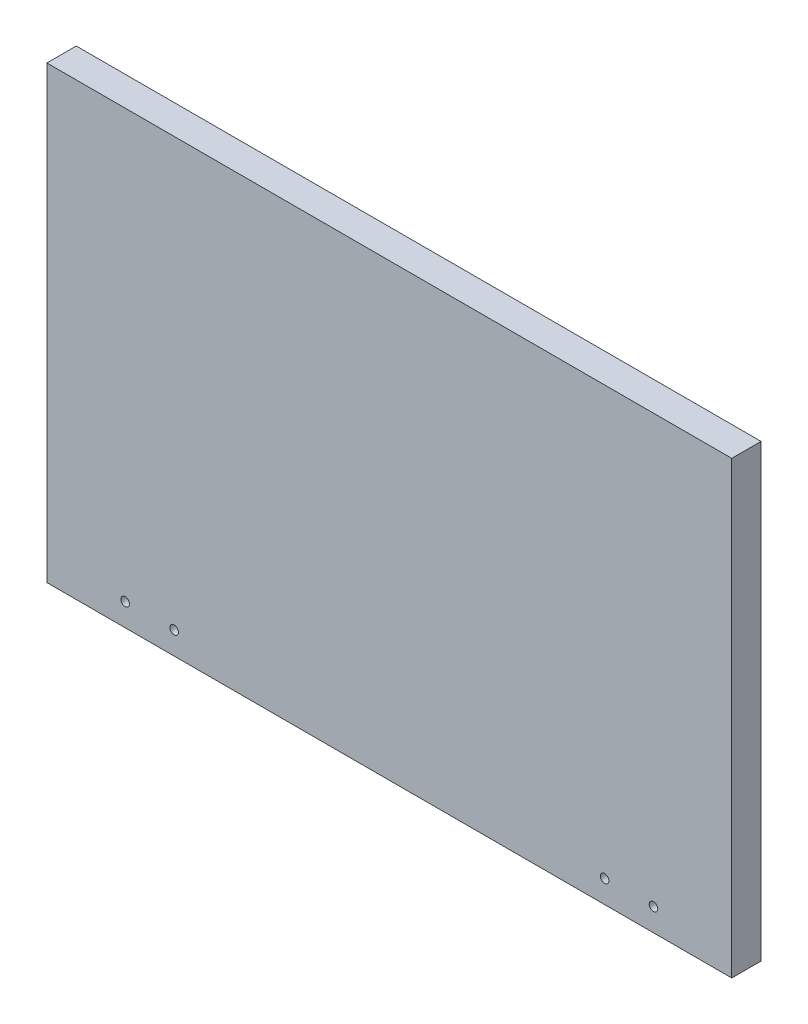
ISO-10303-21;
HEADER;
FILE_DESCRIPTION(('STEP AP214'),'2;1');
FILE_NAME('part.step','',(''),(''),'','','');
FILE_SCHEMA(('AUTOMOTIVE_DESIGN { 1 0 10303 214 1 1 1 1 }'));
ENDSEC;
DATA;
#1=APPLICATION_CONTEXT('core data for automotive mechanical design processes');
#2=APPLICATION_PROTOCOL_DEFINITION('international standard','automotive_design',2000,#1);
#3=PRODUCT_CONTEXT('',#1,'mechanical');
#4=PRODUCT('Part','Part','',(#3));
#5=PRODUCT_RELATED_PRODUCT_CATEGORY('part','',(#4));
#6=PRODUCT_DEFINITION_FORMATION('','',#4);
#7=PRODUCT_DEFINITION_CONTEXT('part definition',#1,'design');
#8=PRODUCT_DEFINITION('design','',#6,#7);
#9=PRODUCT_DEFINITION_SHAPE('','',#8);
#10=(LENGTH_UNIT() NAMED_UNIT(*) SI_UNIT(.MILLI.,.METRE.));
#11=(NAMED_UNIT(*) PLANE_ANGLE_UNIT() SI_UNIT($,.RADIAN.));
#12=(NAMED_UNIT(*) SI_UNIT($,.STERADIAN.) SOLID_ANGLE_UNIT());
#13=UNCERTAINTY_MEASURE_WITH_UNIT(LENGTH_MEASURE(1.E-05),#10,'distance_accuracy_value','');
#14=(GEOMETRIC_REPRESENTATION_CONTEXT(3) GLOBAL_UNCERTAINTY_ASSIGNED_CONTEXT((#13)) GLOBAL_UNIT_ASSIGNED_CONTEXT((#10,
#11,#12)) REPRESENTATION_CONTEXT('',''));
#15=CARTESIAN_POINT('',(0.,0.,0.));
#16=DIRECTION('',(0.,0.,1.));
#17=DIRECTION('',(1.,0.,0.));
#18=AXIS2_PLACEMENT_3D('',#15,#16,#17);
#19=CARTESIAN_POINT('',(175.,115.,15.));
#20=DIRECTION('',(-1.,0.,0.));
#21=DIRECTION('',(0.,0.,1.));
#22=AXIS2_PLACEMENT_3D('',#19,#20,#21);
#23=PLANE('',#22);
#24=DIRECTION('',(0.,1.,0.));
#25=VECTOR('',#24,1.);
#26=CARTESIAN_POINT('',(175.,115.,0.));
#27=LINE('',#26,#25);
#28=CARTESIAN_POINT('',(175.,-115.,0.));
#29=VERTEX_POINT('',#28);
#30=CARTESIAN_POINT('',(175.,115.,0.));
#31=VERTEX_POINT('',#30);
#32=EDGE_CURVE('E95',#29,#31,#27,.T.);
#33=ORIENTED_EDGE('',*,*,#32,.T.);
#34=DIRECTION('',(0.,0.,-1.));
#35=VECTOR('',#34,1.);
#36=CARTESIAN_POINT('',(175.,115.,15.));
#37=LINE('',#36,#35);
#38=CARTESIAN_POINT('',(175.,115.,15.));
#39=VERTEX_POINT('',#38);
#40=EDGE_CURVE('E11',#39,#31,#37,.T.);
#41=ORIENTED_EDGE('',*,*,#40,.F.);
#42=DIRECTION('',(0.,1.,0.));
#43=VECTOR('',#42,1.);
#44=CARTESIAN_POINT('',(175.,115.,15.));
#45=LINE('',#44,#43);
#46=CARTESIAN_POINT('',(175.,-115.,15.));
#47=VERTEX_POINT('',#46);
#48=EDGE_CURVE('E83',#47,#39,#45,.T.);
#49=ORIENTED_EDGE('',*,*,#48,.F.);
#50=DIRECTION('',(0.,0.,-1.));
#51=VECTOR('',#50,1.);
#52=CARTESIAN_POINT('',(175.,-115.,15.));
#53=LINE('',#52,#51);
#54=EDGE_CURVE('E91',#47,#29,#53,.T.);
#55=ORIENTED_EDGE('',*,*,#54,.T.);
#56=EDGE_LOOP('',(#33,#41,#49,#55));
#57=FACE_BOUND('',#56,.T.);
#58=ADVANCED_FACE('F32',(#57),#23,.F.);
#59=CARTESIAN_POINT('',(-175.,115.,15.));
#60=DIRECTION('',(0.,-1.,0.));
#61=DIRECTION('',(0.,0.,-1.));
#62=AXIS2_PLACEMENT_3D('',#59,#60,#61);
#63=PLANE('',#62);
#64=DIRECTION('',(-1.,0.,0.));
#65=VECTOR('',#64,1.);
#66=CARTESIAN_POINT('',(-175.,115.,0.));
#67=LINE('',#66,#65);
#68=CARTESIAN_POINT('',(-175.,115.,0.));
#69=VERTEX_POINT('',#68);
#70=EDGE_CURVE('E87',#31,#69,#67,.T.);
#71=ORIENTED_EDGE('',*,*,#70,.T.);
#72=DIRECTION('',(0.,0.,-1.));
#73=VECTOR('',#72,1.);
#74=CARTESIAN_POINT('',(-175.,115.,15.));
#75=LINE('',#74,#73);
#76=CARTESIAN_POINT('',(-175.,115.,15.));
#77=VERTEX_POINT('',#76);
#78=EDGE_CURVE('E40',#77,#69,#75,.T.);
#79=ORIENTED_EDGE('',*,*,#78,.F.);
#80=DIRECTION('',(-1.,0.,0.));
#81=VECTOR('',#80,1.);
#82=CARTESIAN_POINT('',(-175.,115.,15.));
#83=LINE('',#82,#81);
#84=EDGE_CURVE('E78',#39,#77,#83,.T.);
#85=ORIENTED_EDGE('',*,*,#84,.F.);
#86=ORIENTED_EDGE('',*,*,#40,.T.);
#87=EDGE_LOOP('',(#71,#79,#85,#86));
#88=FACE_BOUND('',#87,.T.);
#89=ADVANCED_FACE('F86',(#88),#63,.F.);
#90=CARTESIAN_POINT('',(-175.,115.,15.));
#91=DIRECTION('',(1.,0.,0.));
#92=DIRECTION('',(0.,0.,-1.));
#93=AXIS2_PLACEMENT_3D('',#90,#91,#92);
#94=PLANE('',#93);
#95=DIRECTION('',(0.,-1.,0.));
#96=VECTOR('',#95,1.);
#97=CARTESIAN_POINT('',(-175.,115.,0.));
#98=LINE('',#97,#96);
#99=CARTESIAN_POINT('',(-175.,-115.,0.));
#100=VERTEX_POINT('',#99);
#101=EDGE_CURVE('E65',#69,#100,#98,.T.);
#102=ORIENTED_EDGE('',*,*,#101,.T.);
#103=DIRECTION('',(0.,0.,-1.));
#104=VECTOR('',#103,1.);
#105=CARTESIAN_POINT('',(-175.,-115.,15.));
#106=LINE('',#105,#104);
#107=CARTESIAN_POINT('',(-175.,-115.,15.));
#108=VERTEX_POINT('',#107);
#109=EDGE_CURVE('E88',#108,#100,#106,.T.);
#110=ORIENTED_EDGE('',*,*,#109,.F.);
#111=DIRECTION('',(0.,-1.,0.));
#112=VECTOR('',#111,1.);
#113=CARTESIAN_POINT('',(-175.,115.,15.));
#114=LINE('',#113,#112);
#115=EDGE_CURVE('E81',#77,#108,#114,.T.);
#116=ORIENTED_EDGE('',*,*,#115,.F.);
#117=ORIENTED_EDGE('',*,*,#78,.T.);
#118=EDGE_LOOP('',(#102,#110,#116,#117));
#119=FACE_BOUND('',#118,.T.);
#120=ADVANCED_FACE('F89',(#119),#94,.F.);
#121=CARTESIAN_POINT('',(-175.,-115.,15.));
#122=DIRECTION('',(0.,1.,0.));
#123=DIRECTION('',(0.,0.,1.));
#124=AXIS2_PLACEMENT_3D('',#121,#122,#123);
#125=PLANE('',#124);
#126=DIRECTION('',(1.,0.,0.));
#127=VECTOR('',#126,1.);
#128=CARTESIAN_POINT('',(-175.,-115.,0.));
#129=LINE('',#128,#127);
#130=EDGE_CURVE('E71',#100,#29,#129,.T.);
#131=ORIENTED_EDGE('',*,*,#130,.T.);
#132=ORIENTED_EDGE('',*,*,#54,.F.);
#133=DIRECTION('',(1.,0.,0.));
#134=VECTOR('',#133,1.);
#135=CARTESIAN_POINT('',(-175.,-115.,15.));
#136=LINE('',#135,#134);
#137=EDGE_CURVE('E48',#108,#47,#136,.T.);
#138=ORIENTED_EDGE('',*,*,#137,.F.);
#139=ORIENTED_EDGE('',*,*,#109,.T.);
#140=EDGE_LOOP('',(#131,#132,#138,#139));
#141=FACE_BOUND('',#140,.T.);
#142=ADVANCED_FACE('F103',(#141),#125,.F.);
#143=CARTESIAN_POINT('',(0.,0.,15.));
#144=DIRECTION('',(0.,0.,1.));
#145=DIRECTION('',(1.,0.,0.));
#146=AXIS2_PLACEMENT_3D('',#143,#144,#145);
#147=PLANE('',#146);
#148=CARTESIAN_POINT('',(110.,-103.4,15.));
#149=DIRECTION('',(0.,0.,-1.));
#150=DIRECTION('',(-1.,0.,0.));
#151=AXIS2_PLACEMENT_3D('',#148,#149,#150);
#152=CIRCLE('',#151,2.20000000000001);
#153=CARTESIAN_POINT('',(107.8,-103.4,15.));
#154=VERTEX_POINT('',#153);
#155=EDGE_CURVE('E124',#154,#154,#152,.T.);
#156=ORIENTED_EDGE('',*,*,#155,.T.);
#157=EDGE_LOOP('',(#156));
#158=FACE_BOUND('',#157,.T.);
#159=CARTESIAN_POINT('',(-110.,-103.4,15.));
#160=DIRECTION('',(0.,0.,-1.));
#161=DIRECTION('',(-1.,0.,0.));
#162=AXIS2_PLACEMENT_3D('',#159,#160,#161);
#163=CIRCLE('',#162,2.20000000000001);
#164=CARTESIAN_POINT('',(-112.2,-103.4,15.));
#165=VERTEX_POINT('',#164);
#166=EDGE_CURVE('E118',#165,#165,#163,.T.);
#167=ORIENTED_EDGE('',*,*,#166,.T.);
#168=EDGE_LOOP('',(#167));
#169=FACE_BOUND('',#168,.T.);
#170=CARTESIAN_POINT('',(135.,-103.4,15.));
#171=DIRECTION('',(0.,0.,-1.));
#172=DIRECTION('',(-1.,0.,0.));
#173=AXIS2_PLACEMENT_3D('',#170,#171,#172);
#174=CIRCLE('',#173,2.20000000000001);
#175=CARTESIAN_POINT('',(132.8,-103.4,15.));
#176=VERTEX_POINT('',#175);
#177=EDGE_CURVE('E112',#176,#176,#174,.T.);
#178=ORIENTED_EDGE('',*,*,#177,.T.);
#179=EDGE_LOOP('',(#178));
#180=FACE_BOUND('',#179,.T.);
#181=CARTESIAN_POINT('',(-135.,-103.4,15.));
#182=DIRECTION('',(0.,0.,-1.));
#183=DIRECTION('',(-1.,0.,0.));
#184=AXIS2_PLACEMENT_3D('',#181,#182,#183);
#185=CIRCLE('',#184,2.20000000000001);
#186=CARTESIAN_POINT('',(-137.2,-103.4,15.));
#187=VERTEX_POINT('',#186);
#188=EDGE_CURVE('E98',#187,#187,#185,.T.);
#189=ORIENTED_EDGE('',*,*,#188,.T.);
#190=EDGE_LOOP('',(#189));
#191=FACE_BOUND('',#190,.T.);
#192=ORIENTED_EDGE('',*,*,#48,.T.);
#193=ORIENTED_EDGE('',*,*,#84,.T.);
#194=ORIENTED_EDGE('',*,*,#115,.T.);
#195=ORIENTED_EDGE('',*,*,#137,.T.);
#196=EDGE_LOOP('',(#192,#193,#194,#195));
#197=FACE_BOUND('',#196,.T.);
#198=ADVANCED_FACE('F79',(#158,#169,#180,#191,#197),#147,.T.);
#199=CARTESIAN_POINT('',(0.,0.,0.));
#200=DIRECTION('',(0.,0.,1.));
#201=DIRECTION('',(1.,0.,0.));
#202=AXIS2_PLACEMENT_3D('',#199,#200,#201);
#203=PLANE('',#202);
#204=CARTESIAN_POINT('',(110.,-103.4,0.));
#205=DIRECTION('',(0.,0.,-1.));
#206=DIRECTION('',(-1.,0.,0.));
#207=AXIS2_PLACEMENT_3D('',#204,#205,#206);
#208=CIRCLE('',#207,2.20000000000001);
#209=CARTESIAN_POINT('',(107.8,-103.4,0.));
#210=VERTEX_POINT('',#209);
#211=EDGE_CURVE('E127',#210,#210,#208,.T.);
#212=ORIENTED_EDGE('',*,*,#211,.F.);
#213=EDGE_LOOP('',(#212));
#214=FACE_BOUND('',#213,.T.);
#215=CARTESIAN_POINT('',(-110.,-103.4,0.));
#216=DIRECTION('',(0.,0.,-1.));
#217=DIRECTION('',(-1.,0.,0.));
#218=AXIS2_PLACEMENT_3D('',#215,#216,#217);
#219=CIRCLE('',#218,2.20000000000001);
#220=CARTESIAN_POINT('',(-112.2,-103.4,0.));
#221=VERTEX_POINT('',#220);
#222=EDGE_CURVE('E121',#221,#221,#219,.T.);
#223=ORIENTED_EDGE('',*,*,#222,.F.);
#224=EDGE_LOOP('',(#223));
#225=FACE_BOUND('',#224,.T.);
#226=CARTESIAN_POINT('',(135.,-103.4,0.));
#227=DIRECTION('',(0.,0.,-1.));
#228=DIRECTION('',(-1.,0.,0.));
#229=AXIS2_PLACEMENT_3D('',#226,#227,#228);
#230=CIRCLE('',#229,2.20000000000001);
#231=CARTESIAN_POINT('',(132.8,-103.4,0.));
#232=VERTEX_POINT('',#231);
#233=EDGE_CURVE('E115',#232,#232,#230,.T.);
#234=ORIENTED_EDGE('',*,*,#233,.F.);
#235=EDGE_LOOP('',(#234));
#236=FACE_BOUND('',#235,.T.);
#237=CARTESIAN_POINT('',(-135.,-103.4,0.));
#238=DIRECTION('',(0.,0.,-1.));
#239=DIRECTION('',(-1.,0.,0.));
#240=AXIS2_PLACEMENT_3D('',#237,#238,#239);
#241=CIRCLE('',#240,2.20000000000001);
#242=CARTESIAN_POINT('',(-137.2,-103.4,0.));
#243=VERTEX_POINT('',#242);
#244=EDGE_CURVE('E109',#243,#243,#241,.T.);
#245=ORIENTED_EDGE('',*,*,#244,.F.);
#246=EDGE_LOOP('',(#245));
#247=FACE_BOUND('',#246,.T.);
#248=ORIENTED_EDGE('',*,*,#32,.F.);
#249=ORIENTED_EDGE('',*,*,#130,.F.);
#250=ORIENTED_EDGE('',*,*,#101,.F.);
#251=ORIENTED_EDGE('',*,*,#70,.F.);
#252=EDGE_LOOP('',(#248,#249,#250,#251));
#253=FACE_BOUND('',#252,.T.);
#254=ADVANCED_FACE('F106',(#214,#225,#236,#247,#253),#203,.F.);
#255=CARTESIAN_POINT('',(-135.,-103.4,15.));
#256=DIRECTION('',(0.,0.,-1.));
#257=DIRECTION('',(-1.,0.,0.));
#258=AXIS2_PLACEMENT_3D('',#255,#256,#257);
#259=CYLINDRICAL_SURFACE('',#258,2.20000000000001);
#260=ORIENTED_EDGE('',*,*,#188,.F.);
#261=EDGE_LOOP('',(#260));
#262=FACE_BOUND('',#261,.T.);
#263=ORIENTED_EDGE('',*,*,#244,.T.);
#264=EDGE_LOOP('',(#263));
#265=FACE_BOUND('',#264,.T.);
#266=ADVANCED_FACE('F144',(#262,#265),#259,.F.);
#267=CARTESIAN_POINT('',(135.,-103.4,15.));
#268=DIRECTION('',(0.,0.,-1.));
#269=DIRECTION('',(-1.,0.,0.));
#270=AXIS2_PLACEMENT_3D('',#267,#268,#269);
#271=CYLINDRICAL_SURFACE('',#270,2.20000000000001);
#272=ORIENTED_EDGE('',*,*,#177,.F.);
#273=EDGE_LOOP('',(#272));
#274=FACE_BOUND('',#273,.T.);
#275=ORIENTED_EDGE('',*,*,#233,.T.);
#276=EDGE_LOOP('',(#275));
#277=FACE_BOUND('',#276,.T.);
#278=ADVANCED_FACE('F153',(#274,#277),#271,.F.);
#279=CARTESIAN_POINT('',(-110.,-103.4,15.));
#280=DIRECTION('',(0.,0.,-1.));
#281=DIRECTION('',(-1.,0.,0.));
#282=AXIS2_PLACEMENT_3D('',#279,#280,#281);
#283=CYLINDRICAL_SURFACE('',#282,2.20000000000001);
#284=ORIENTED_EDGE('',*,*,#166,.F.);
#285=EDGE_LOOP('',(#284));
#286=FACE_BOUND('',#285,.T.);
#287=ORIENTED_EDGE('',*,*,#222,.T.);
#288=EDGE_LOOP('',(#287));
#289=FACE_BOUND('',#288,.T.);
#290=ADVANCED_FACE('F138',(#286,#289),#283,.F.);
#291=CARTESIAN_POINT('',(110.,-103.4,15.));
#292=DIRECTION('',(0.,0.,-1.));
#293=DIRECTION('',(-1.,0.,0.));
#294=AXIS2_PLACEMENT_3D('',#291,#292,#293);
#295=CYLINDRICAL_SURFACE('',#294,2.20000000000001);
#296=ORIENTED_EDGE('',*,*,#155,.F.);
#297=EDGE_LOOP('',(#296));
#298=FACE_BOUND('',#297,.T.);
#299=ORIENTED_EDGE('',*,*,#211,.T.);
#300=EDGE_LOOP('',(#299));
#301=FACE_BOUND('',#300,.T.);
#302=ADVANCED_FACE('F135',(#298,#301),#295,.F.);
#303=CLOSED_SHELL('',(#58,#89,#120,#142,#198,#254,#266,#278,#290,#302));
#304=MANIFOLD_SOLID_BREP('B2',#303);
#305=ADVANCED_BREP_SHAPE_REPRESENTATION('',(#18,#304),#14);
#306=SHAPE_DEFINITION_REPRESENTATION(#9,#305);
ENDSEC;
END-ISO-10303-21;
